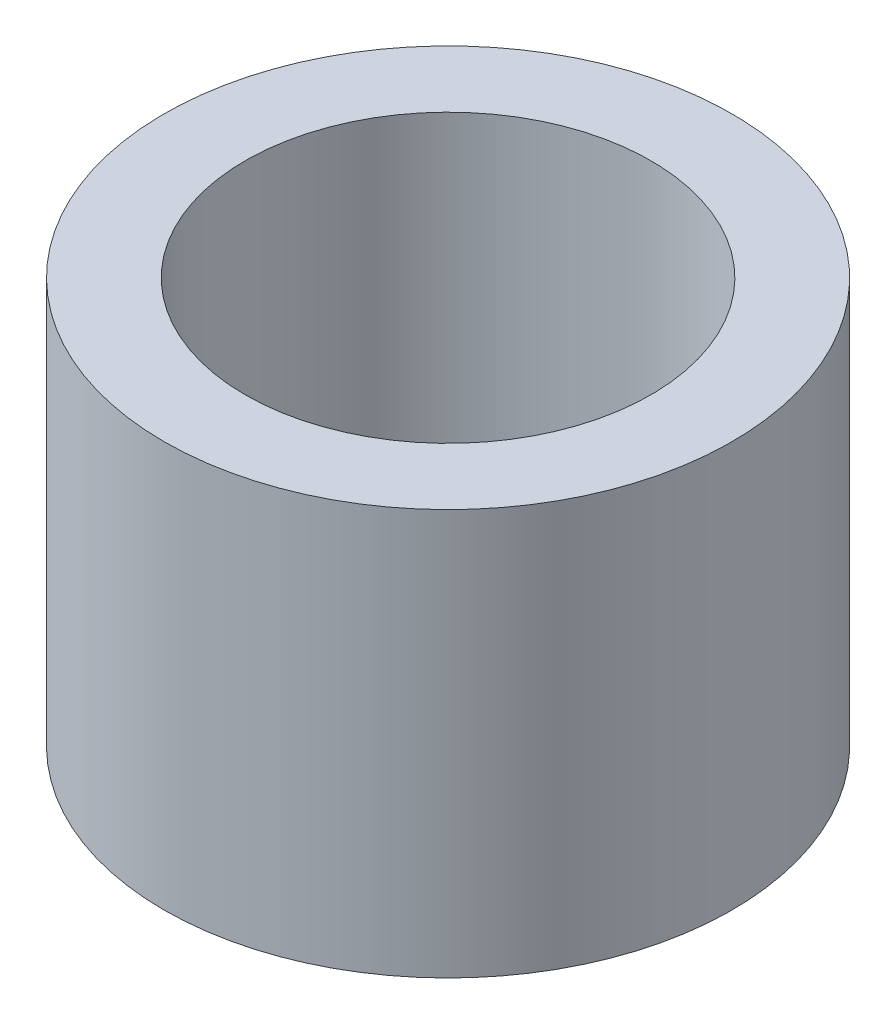
ISO-10303-21;
HEADER;
FILE_DESCRIPTION(('STEP AP214'),'2;1');
FILE_NAME('part.step','',(''),(''),'','','');
FILE_SCHEMA(('AUTOMOTIVE_DESIGN { 1 0 10303 214 1 1 1 1 }'));
ENDSEC;
DATA;
#1=APPLICATION_CONTEXT('core data for automotive mechanical design processes');
#2=APPLICATION_PROTOCOL_DEFINITION('international standard','automotive_design',2000,#1);
#3=PRODUCT_CONTEXT('',#1,'mechanical');
#4=PRODUCT('Part','Part','',(#3));
#5=PRODUCT_RELATED_PRODUCT_CATEGORY('part','',(#4));
#6=PRODUCT_DEFINITION_FORMATION('','',#4);
#7=PRODUCT_DEFINITION_CONTEXT('part definition',#1,'design');
#8=PRODUCT_DEFINITION('design','',#6,#7);
#9=PRODUCT_DEFINITION_SHAPE('','',#8);
#10=(LENGTH_UNIT() NAMED_UNIT(*) SI_UNIT(.MILLI.,.METRE.));
#11=(NAMED_UNIT(*) PLANE_ANGLE_UNIT() SI_UNIT($,.RADIAN.));
#12=(NAMED_UNIT(*) SI_UNIT($,.STERADIAN.) SOLID_ANGLE_UNIT());
#13=UNCERTAINTY_MEASURE_WITH_UNIT(LENGTH_MEASURE(1.E-05),#10,'distance_accuracy_value','');
#14=(GEOMETRIC_REPRESENTATION_CONTEXT(3) GLOBAL_UNCERTAINTY_ASSIGNED_CONTEXT((#13)) GLOBAL_UNIT_ASSIGNED_CONTEXT((#10,
#11,#12)) REPRESENTATION_CONTEXT('',''));
#15=CARTESIAN_POINT('',(0.,0.,0.));
#16=DIRECTION('',(0.,0.,1.));
#17=DIRECTION('',(1.,0.,0.));
#18=AXIS2_PLACEMENT_3D('',#15,#16,#17);
#19=CARTESIAN_POINT('',(0.,5.,0.));
#20=DIRECTION('',(0.,1.,0.));
#21=DIRECTION('',(0.,0.,1.));
#22=AXIS2_PLACEMENT_3D('',#19,#20,#21);
#23=PLANE('',#22);
#24=CARTESIAN_POINT('',(0.,5.,0.));
#25=DIRECTION('',(0.,1.,0.));
#26=DIRECTION('',(0.,0.,1.));
#27=AXIS2_PLACEMENT_3D('',#24,#25,#26);
#28=CIRCLE('',#27,3.5);
#29=CARTESIAN_POINT('',(0.,5.,3.5));
#30=VERTEX_POINT('',#29);
#31=EDGE_CURVE('E10',#30,#30,#28,.T.);
#32=ORIENTED_EDGE('',*,*,#31,.T.);
#33=EDGE_LOOP('',(#32));
#34=FACE_BOUND('',#33,.T.);
#35=CARTESIAN_POINT('',(0.,5.,0.));
#36=DIRECTION('',(0.,1.,0.));
#37=DIRECTION('',(0.,0.,1.));
#38=AXIS2_PLACEMENT_3D('',#35,#36,#37);
#39=CIRCLE('',#38,2.5);
#40=CARTESIAN_POINT('',(0.,5.,2.5));
#41=VERTEX_POINT('',#40);
#42=EDGE_CURVE('E53',#41,#41,#39,.T.);
#43=ORIENTED_EDGE('',*,*,#42,.F.);
#44=EDGE_LOOP('',(#43));
#45=FACE_BOUND('',#44,.T.);
#46=ADVANCED_FACE('F37',(#34,#45),#23,.T.);
#47=CARTESIAN_POINT('',(0.,0.,0.));
#48=DIRECTION('',(0.,1.,0.));
#49=DIRECTION('',(0.,0.,1.));
#50=AXIS2_PLACEMENT_3D('',#47,#48,#49);
#51=PLANE('',#50);
#52=CARTESIAN_POINT('',(0.,0.,0.));
#53=DIRECTION('',(0.,1.,0.));
#54=DIRECTION('',(0.,0.,1.));
#55=AXIS2_PLACEMENT_3D('',#52,#53,#54);
#56=CIRCLE('',#55,3.5);
#57=CARTESIAN_POINT('',(0.,0.,3.5));
#58=VERTEX_POINT('',#57);
#59=EDGE_CURVE('E41',#58,#58,#56,.T.);
#60=ORIENTED_EDGE('',*,*,#59,.F.);
#61=EDGE_LOOP('',(#60));
#62=FACE_BOUND('',#61,.T.);
#63=CARTESIAN_POINT('',(0.,0.,0.));
#64=DIRECTION('',(0.,1.,0.));
#65=DIRECTION('',(0.,0.,1.));
#66=AXIS2_PLACEMENT_3D('',#63,#64,#65);
#67=CIRCLE('',#66,2.5);
#68=CARTESIAN_POINT('',(0.,0.,2.5));
#69=VERTEX_POINT('',#68);
#70=EDGE_CURVE('E55',#69,#69,#67,.T.);
#71=ORIENTED_EDGE('',*,*,#70,.T.);
#72=EDGE_LOOP('',(#71));
#73=FACE_BOUND('',#72,.T.);
#74=ADVANCED_FACE('F66',(#62,#73),#51,.F.);
#75=CARTESIAN_POINT('',(0.,5.,0.));
#76=DIRECTION('',(0.,-1.,0.));
#77=DIRECTION('',(0.,0.,-1.));
#78=AXIS2_PLACEMENT_3D('',#75,#76,#77);
#79=CYLINDRICAL_SURFACE('',#78,3.5);
#80=ORIENTED_EDGE('',*,*,#31,.F.);
#81=EDGE_LOOP('',(#80));
#82=FACE_BOUND('',#81,.T.);
#83=ORIENTED_EDGE('',*,*,#59,.T.);
#84=EDGE_LOOP('',(#83));
#85=FACE_BOUND('',#84,.T.);
#86=ADVANCED_FACE('F39',(#82,#85),#79,.T.);
#87=CARTESIAN_POINT('',(0.,5.,0.));
#88=DIRECTION('',(0.,-1.,0.));
#89=DIRECTION('',(0.,0.,-1.));
#90=AXIS2_PLACEMENT_3D('',#87,#88,#89);
#91=CYLINDRICAL_SURFACE('',#90,2.5);
#92=ORIENTED_EDGE('',*,*,#42,.T.);
#93=EDGE_LOOP('',(#92));
#94=FACE_BOUND('',#93,.T.);
#95=ORIENTED_EDGE('',*,*,#70,.F.);
#96=EDGE_LOOP('',(#95));
#97=FACE_BOUND('',#96,.T.);
#98=ADVANCED_FACE('F62',(#94,#97),#91,.F.);
#99=CLOSED_SHELL('',(#46,#74,#86,#98));
#100=MANIFOLD_SOLID_BREP('B2',#99);
#101=ADVANCED_BREP_SHAPE_REPRESENTATION('',(#18,#100),#14);
#102=SHAPE_DEFINITION_REPRESENTATION(#9,#101);
ENDSEC;
END-ISO-10303-21;
